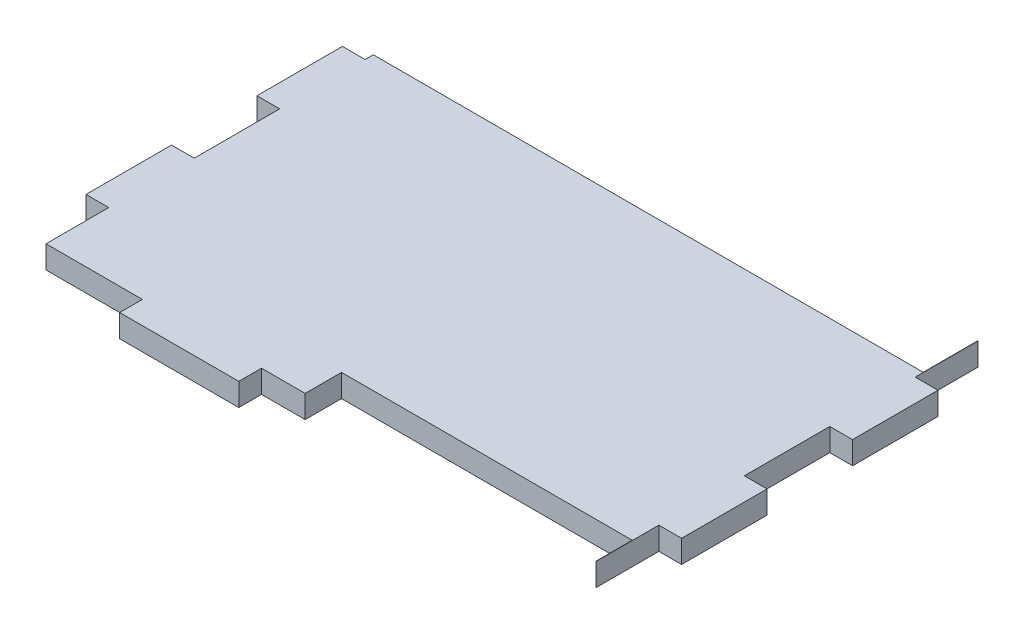
ISO-10303-21;
HEADER;
FILE_DESCRIPTION(('STEP AP214'),'2;1');
FILE_NAME('part.step','',(''),(''),'','','');
FILE_SCHEMA(('AUTOMOTIVE_DESIGN { 1 0 10303 214 1 1 1 1 }'));
ENDSEC;
DATA;
#1=APPLICATION_CONTEXT('core data for automotive mechanical design processes');
#2=APPLICATION_PROTOCOL_DEFINITION('international standard','automotive_design',2000,#1);
#3=PRODUCT_CONTEXT('',#1,'mechanical');
#4=PRODUCT('Part','Part','',(#3));
#5=PRODUCT_RELATED_PRODUCT_CATEGORY('part','',(#4));
#6=PRODUCT_DEFINITION_FORMATION('','',#4);
#7=PRODUCT_DEFINITION_CONTEXT('part definition',#1,'design');
#8=PRODUCT_DEFINITION('design','',#6,#7);
#9=PRODUCT_DEFINITION_SHAPE('','',#8);
#10=(LENGTH_UNIT() NAMED_UNIT(*) SI_UNIT(.MILLI.,.METRE.));
#11=(NAMED_UNIT(*) PLANE_ANGLE_UNIT() SI_UNIT($,.RADIAN.));
#12=(NAMED_UNIT(*) SI_UNIT($,.STERADIAN.) SOLID_ANGLE_UNIT());
#13=UNCERTAINTY_MEASURE_WITH_UNIT(LENGTH_MEASURE(1.E-05),#10,'distance_accuracy_value','');
#14=(GEOMETRIC_REPRESENTATION_CONTEXT(3) GLOBAL_UNCERTAINTY_ASSIGNED_CONTEXT((#13)) GLOBAL_UNIT_ASSIGNED_CONTEXT((#10,
#11,#12)) REPRESENTATION_CONTEXT('',''));
#15=CARTESIAN_POINT('',(0.,0.,0.));
#16=DIRECTION('',(0.,0.,1.));
#17=DIRECTION('',(1.,0.,0.));
#18=AXIS2_PLACEMENT_3D('',#15,#16,#17);
#19=CARTESIAN_POINT('',(41.5925,3.175,29.845));
#20=DIRECTION('',(-1.,0.,0.));
#21=DIRECTION('',(0.,0.,1.));
#22=AXIS2_PLACEMENT_3D('',#19,#20,#21);
#23=PLANE('',#22);
#24=DIRECTION('',(0.,0.,-1.));
#25=VECTOR('',#24,1.);
#26=CARTESIAN_POINT('',(41.5925,3.175,29.845));
#27=LINE('',#26,#25);
#28=CARTESIAN_POINT('',(41.5925,3.175,17.907));
#29=VERTEX_POINT('',#28);
#30=CARTESIAN_POINT('',(41.5925,3.175,5.96899999999999));
#31=VERTEX_POINT('',#30);
#32=EDGE_CURVE('E434',#29,#31,#27,.T.);
#33=ORIENTED_EDGE('',*,*,#32,.F.);
#34=DIRECTION('',(0.,1.,0.));
#35=VECTOR('',#34,1.);
#36=CARTESIAN_POINT('',(41.5925,0.,17.907));
#37=LINE('',#36,#35);
#38=CARTESIAN_POINT('',(41.5925,0.,17.907));
#39=VERTEX_POINT('',#38);
#40=EDGE_CURVE('E328',#39,#29,#37,.T.);
#41=ORIENTED_EDGE('',*,*,#40,.F.);
#42=DIRECTION('',(0.,0.,-1.));
#43=VECTOR('',#42,1.);
#44=CARTESIAN_POINT('',(41.5925,0.,29.845));
#45=LINE('',#44,#43);
#46=CARTESIAN_POINT('',(41.5925,0.,5.96899999999999));
#47=VERTEX_POINT('',#46);
#48=EDGE_CURVE('E445',#39,#47,#45,.T.);
#49=ORIENTED_EDGE('',*,*,#48,.T.);
#50=DIRECTION('',(0.,1.,0.));
#51=VECTOR('',#50,1.);
#52=CARTESIAN_POINT('',(41.5925,0.,5.96899999999999));
#53=LINE('',#52,#51);
#54=EDGE_CURVE('E351',#47,#31,#53,.T.);
#55=ORIENTED_EDGE('',*,*,#54,.T.);
#56=EDGE_LOOP('',(#33,#41,#49,#55));
#57=FACE_BOUND('',#56,.T.);
#58=ADVANCED_FACE('F35',(#57),#23,.F.);
#59=CARTESIAN_POINT('',(-41.5925,3.175,29.845));
#60=DIRECTION('',(1.,0.,0.));
#61=DIRECTION('',(0.,0.,-1.));
#62=AXIS2_PLACEMENT_3D('',#59,#60,#61);
#63=PLANE('',#62);
#64=DIRECTION('',(0.,0.,1.));
#65=VECTOR('',#64,1.);
#66=CARTESIAN_POINT('',(-41.5925,0.,29.845));
#67=LINE('',#66,#65);
#68=CARTESIAN_POINT('',(-41.5925,0.,-17.907));
#69=VERTEX_POINT('',#68);
#70=CARTESIAN_POINT('',(-41.5925,0.,-5.96900000000001));
#71=VERTEX_POINT('',#70);
#72=EDGE_CURVE('E446',#69,#71,#67,.T.);
#73=ORIENTED_EDGE('',*,*,#72,.T.);
#74=DIRECTION('',(0.,1.,0.));
#75=VECTOR('',#74,1.);
#76=CARTESIAN_POINT('',(-41.5925,0.,-5.96900000000001));
#77=LINE('',#76,#75);
#78=CARTESIAN_POINT('',(-41.5925,3.175,-5.96900000000001));
#79=VERTEX_POINT('',#78);
#80=EDGE_CURVE('E313',#71,#79,#77,.T.);
#81=ORIENTED_EDGE('',*,*,#80,.T.);
#82=DIRECTION('',(0.,0.,1.));
#83=VECTOR('',#82,1.);
#84=CARTESIAN_POINT('',(-41.5925,3.175,29.845));
#85=LINE('',#84,#83);
#86=CARTESIAN_POINT('',(-41.5925,3.175,-17.907));
#87=VERTEX_POINT('',#86);
#88=EDGE_CURVE('E436',#87,#79,#85,.T.);
#89=ORIENTED_EDGE('',*,*,#88,.F.);
#90=DIRECTION('',(0.,1.,0.));
#91=VECTOR('',#90,1.);
#92=CARTESIAN_POINT('',(-41.5925,0.,-17.907));
#93=LINE('',#92,#91);
#94=EDGE_CURVE('E386',#69,#87,#93,.T.);
#95=ORIENTED_EDGE('',*,*,#94,.F.);
#96=EDGE_LOOP('',(#73,#81,#89,#95));
#97=FACE_BOUND('',#96,.T.);
#98=ADVANCED_FACE('F497',(#97),#63,.F.);
#99=CARTESIAN_POINT('',(-41.5925,3.175,29.845));
#100=DIRECTION('',(0.,0.,-1.));
#101=DIRECTION('',(-1.,0.,0.));
#102=AXIS2_PLACEMENT_3D('',#99,#100,#101);
#103=PLANE('',#102);
#104=DIRECTION('',(1.,0.,0.));
#105=VECTOR('',#104,1.);
#106=CARTESIAN_POINT('',(-41.5925,0.,29.845));
#107=LINE('',#106,#105);
#108=CARTESIAN_POINT('',(-24.9555,0.,29.845));
#109=VERTEX_POINT('',#108);
#110=CARTESIAN_POINT('',(-8.31850000000001,0.,29.845));
#111=VERTEX_POINT('',#110);
#112=EDGE_CURVE('E435',#109,#111,#107,.T.);
#113=ORIENTED_EDGE('',*,*,#112,.T.);
#114=DIRECTION('',(0.,1.,0.));
#115=VECTOR('',#114,1.);
#116=CARTESIAN_POINT('',(-8.31850000000001,0.,29.845));
#117=LINE('',#116,#115);
#118=CARTESIAN_POINT('',(-8.31850000000001,3.175,29.845));
#119=VERTEX_POINT('',#118);
#120=EDGE_CURVE('E403',#111,#119,#117,.T.);
#121=ORIENTED_EDGE('',*,*,#120,.T.);
#122=DIRECTION('',(1.,0.,0.));
#123=VECTOR('',#122,1.);
#124=CARTESIAN_POINT('',(-41.5925,3.175,29.845));
#125=LINE('',#124,#123);
#126=CARTESIAN_POINT('',(-24.9555,3.175,29.845));
#127=VERTEX_POINT('',#126);
#128=EDGE_CURVE('E439',#127,#119,#125,.T.);
#129=ORIENTED_EDGE('',*,*,#128,.F.);
#130=DIRECTION('',(0.,1.,0.));
#131=VECTOR('',#130,1.);
#132=CARTESIAN_POINT('',(-24.9555,0.,29.845));
#133=LINE('',#132,#131);
#134=EDGE_CURVE('E423',#109,#127,#133,.T.);
#135=ORIENTED_EDGE('',*,*,#134,.F.);
#136=EDGE_LOOP('',(#113,#121,#129,#135));
#137=FACE_BOUND('',#136,.T.);
#138=ADVANCED_FACE('F540',(#137),#103,.F.);
#139=CARTESIAN_POINT('',(41.5925,3.175,-5.96900000000001));
#140=VERTEX_POINT('',#139);
#141=CARTESIAN_POINT('',(41.5925,3.175,-17.907));
#142=VERTEX_POINT('',#141);
#143=EDGE_CURVE('E432',#140,#142,#27,.T.);
#144=ORIENTED_EDGE('',*,*,#143,.F.);
#145=DIRECTION('',(0.,1.,0.));
#146=VECTOR('',#145,1.);
#147=CARTESIAN_POINT('',(41.5925,0.,-5.96900000000001));
#148=LINE('',#147,#146);
#149=CARTESIAN_POINT('',(41.5925,0.,-5.96900000000001));
#150=VERTEX_POINT('',#149);
#151=EDGE_CURVE('E344',#150,#140,#148,.T.);
#152=ORIENTED_EDGE('',*,*,#151,.F.);
#153=CARTESIAN_POINT('',(41.5925,0.,-17.907));
#154=VERTEX_POINT('',#153);
#155=EDGE_CURVE('E430',#150,#154,#45,.T.);
#156=ORIENTED_EDGE('',*,*,#155,.T.);
#157=DIRECTION('',(0.,1.,0.));
#158=VECTOR('',#157,1.);
#159=CARTESIAN_POINT('',(41.5925,0.,-17.907));
#160=LINE('',#159,#158);
#161=EDGE_CURVE('E373',#154,#142,#160,.T.);
#162=ORIENTED_EDGE('',*,*,#161,.T.);
#163=EDGE_LOOP('',(#144,#152,#156,#162));
#164=FACE_BOUND('',#163,.T.);
#165=ADVANCED_FACE('F37',(#164),#23,.F.);
#166=CARTESIAN_POINT('',(-41.5925,3.175,5.96899999999999));
#167=VERTEX_POINT('',#166);
#168=CARTESIAN_POINT('',(-41.5925,3.175,17.907));
#169=VERTEX_POINT('',#168);
#170=EDGE_CURVE('E440',#167,#169,#85,.T.);
#171=ORIENTED_EDGE('',*,*,#170,.F.);
#172=DIRECTION('',(0.,1.,0.));
#173=VECTOR('',#172,1.);
#174=CARTESIAN_POINT('',(-41.5925,0.,5.96899999999999));
#175=LINE('',#174,#173);
#176=CARTESIAN_POINT('',(-41.5925,0.,5.96899999999999));
#177=VERTEX_POINT('',#176);
#178=EDGE_CURVE('E304',#177,#167,#175,.T.);
#179=ORIENTED_EDGE('',*,*,#178,.F.);
#180=CARTESIAN_POINT('',(-41.5925,0.,17.907));
#181=VERTEX_POINT('',#180);
#182=EDGE_CURVE('E449',#177,#181,#67,.T.);
#183=ORIENTED_EDGE('',*,*,#182,.T.);
#184=DIRECTION('',(0.,1.,0.));
#185=VECTOR('',#184,1.);
#186=CARTESIAN_POINT('',(-41.5925,0.,17.907));
#187=LINE('',#186,#185);
#188=EDGE_CURVE('E288',#181,#169,#187,.T.);
#189=ORIENTED_EDGE('',*,*,#188,.T.);
#190=EDGE_LOOP('',(#171,#179,#183,#189));
#191=FACE_BOUND('',#190,.T.);
#192=ADVANCED_FACE('F515',(#191),#63,.F.);
#193=CARTESIAN_POINT('',(0.,3.175,0.));
#194=DIRECTION('',(0.,-1.,0.));
#195=DIRECTION('',(0.,0.,-1.));
#196=AXIS2_PLACEMENT_3D('',#193,#194,#195);
#197=PLANE('',#196);
#198=DIRECTION('',(-1.,0.,0.));
#199=VECTOR('',#198,1.);
#200=CARTESIAN_POINT('',(-8.31850000000001,3.175,26.67));
#201=LINE('',#200,#199);
#202=CARTESIAN_POINT('',(-2.2225,3.175,26.67));
#203=VERTEX_POINT('',#202);
#204=CARTESIAN_POINT('',(-8.31850000000001,3.175,26.67));
#205=VERTEX_POINT('',#204);
#206=EDGE_CURVE('E401',#203,#205,#201,.T.);
#207=ORIENTED_EDGE('',*,*,#206,.F.);
#208=DIRECTION('',(0.,0.,1.));
#209=VECTOR('',#208,1.);
#210=CARTESIAN_POINT('',(-2.2225,3.175,21.59));
#211=LINE('',#210,#209);
#212=CARTESIAN_POINT('',(-2.2225,3.175,21.59));
#213=VERTEX_POINT('',#212);
#214=EDGE_CURVE('E50',#213,#203,#211,.T.);
#215=ORIENTED_EDGE('',*,*,#214,.F.);
#216=DIRECTION('',(-1.,0.,0.));
#217=VECTOR('',#216,1.);
#218=CARTESIAN_POINT('',(-2.2225,3.175,21.59));
#219=LINE('',#218,#217);
#220=CARTESIAN_POINT('',(38.3840670883249,3.175,21.59));
#221=VERTEX_POINT('',#220);
#222=EDGE_CURVE('E257',#221,#213,#219,.T.);
#223=ORIENTED_EDGE('',*,*,#222,.F.);
#224=DIRECTION('',(0.,0.,-1.));
#225=VECTOR('',#224,1.);
#226=CARTESIAN_POINT('',(38.3840670883249,3.175,21.59));
#227=LINE('',#226,#225);
#228=CARTESIAN_POINT('',(38.3840670883249,3.175,26.67));
#229=VERTEX_POINT('',#228);
#230=EDGE_CURVE('E237',#229,#221,#227,.T.);
#231=ORIENTED_EDGE('',*,*,#230,.F.);
#232=DIRECTION('',(-1.,0.,0.));
#233=VECTOR('',#232,1.);
#234=CARTESIAN_POINT('',(24.9555,3.175,26.67));
#235=LINE('',#234,#233);
#236=CARTESIAN_POINT('',(38.4175,3.175,26.67));
#237=VERTEX_POINT('',#236);
#238=EDGE_CURVE('E376',#237,#229,#235,.T.);
#239=ORIENTED_EDGE('',*,*,#238,.F.);
#240=DIRECTION('',(0.,0.,1.));
#241=VECTOR('',#240,1.);
#242=CARTESIAN_POINT('',(38.4175,3.175,17.907));
#243=LINE('',#242,#241);
#244=CARTESIAN_POINT('',(38.4175,3.175,17.907));
#245=VERTEX_POINT('',#244);
#246=EDGE_CURVE('E326',#245,#237,#243,.T.);
#247=ORIENTED_EDGE('',*,*,#246,.F.);
#248=DIRECTION('',(-1.,0.,0.));
#249=VECTOR('',#248,1.);
#250=CARTESIAN_POINT('',(41.5925,3.175,17.907));
#251=LINE('',#250,#249);
#252=EDGE_CURVE('E291',#29,#245,#251,.T.);
#253=ORIENTED_EDGE('',*,*,#252,.F.);
#254=ORIENTED_EDGE('',*,*,#32,.T.);
#255=DIRECTION('',(1.,0.,0.));
#256=VECTOR('',#255,1.);
#257=CARTESIAN_POINT('',(41.5925,3.175,5.96899999999999));
#258=LINE('',#257,#256);
#259=CARTESIAN_POINT('',(38.4175,3.175,5.96899999999999));
#260=VERTEX_POINT('',#259);
#261=EDGE_CURVE('E338',#260,#31,#258,.T.);
#262=ORIENTED_EDGE('',*,*,#261,.F.);
#263=DIRECTION('',(0.,0.,1.));
#264=VECTOR('',#263,1.);
#265=CARTESIAN_POINT('',(38.4175,3.175,-5.96900000000001));
#266=LINE('',#265,#264);
#267=CARTESIAN_POINT('',(38.4175,3.175,-5.96900000000001));
#268=VERTEX_POINT('',#267);
#269=EDGE_CURVE('E347',#268,#260,#266,.T.);
#270=ORIENTED_EDGE('',*,*,#269,.F.);
#271=DIRECTION('',(-1.,0.,0.));
#272=VECTOR('',#271,1.);
#273=CARTESIAN_POINT('',(41.5925,3.175,-5.96900000000001));
#274=LINE('',#273,#272);
#275=EDGE_CURVE('E316',#140,#268,#274,.T.);
#276=ORIENTED_EDGE('',*,*,#275,.F.);
#277=ORIENTED_EDGE('',*,*,#143,.T.);
#278=DIRECTION('',(1.,0.,0.));
#279=VECTOR('',#278,1.);
#280=CARTESIAN_POINT('',(41.5925,3.175,-17.907));
#281=LINE('',#280,#279);
#282=CARTESIAN_POINT('',(38.4175,3.175,-17.907));
#283=VERTEX_POINT('',#282);
#284=EDGE_CURVE('E364',#283,#142,#281,.T.);
#285=ORIENTED_EDGE('',*,*,#284,.F.);
#286=DIRECTION('',(0.,0.,1.));
#287=VECTOR('',#286,1.);
#288=CARTESIAN_POINT('',(38.4175,3.175,-29.845));
#289=LINE('',#288,#287);
#290=CARTESIAN_POINT('',(38.4175,3.175,-26.67));
#291=VERTEX_POINT('',#290);
#292=EDGE_CURVE('E368',#291,#283,#289,.T.);
#293=ORIENTED_EDGE('',*,*,#292,.F.);
#294=DIRECTION('',(1.,0.,0.));
#295=VECTOR('',#294,1.);
#296=CARTESIAN_POINT('',(24.9555,3.175,-26.67));
#297=LINE('',#296,#295);
#298=CARTESIAN_POINT('',(38.3840670883249,3.175,-26.67));
#299=VERTEX_POINT('',#298);
#300=EDGE_CURVE('E394',#299,#291,#297,.T.);
#301=ORIENTED_EDGE('',*,*,#300,.F.);
#302=DIRECTION('',(0.,0.,-1.));
#303=VECTOR('',#302,1.);
#304=CARTESIAN_POINT('',(38.3840670883249,3.175,-19.05));
#305=LINE('',#304,#303);
#306=CARTESIAN_POINT('',(38.3840670883249,3.175,-19.05));
#307=VERTEX_POINT('',#306);
#308=EDGE_CURVE('E268',#307,#299,#305,.T.);
#309=ORIENTED_EDGE('',*,*,#308,.F.);
#310=DIRECTION('',(1.,0.,0.));
#311=VECTOR('',#310,1.);
#312=CARTESIAN_POINT('',(-38.4175,3.175,-19.05));
#313=LINE('',#312,#311);
#314=CARTESIAN_POINT('',(-38.4175,3.175,-19.05));
#315=VERTEX_POINT('',#314);
#316=EDGE_CURVE('E272',#315,#307,#313,.T.);
#317=ORIENTED_EDGE('',*,*,#316,.F.);
#318=DIRECTION('',(0.,0.,-1.));
#319=VECTOR('',#318,1.);
#320=CARTESIAN_POINT('',(-38.4175,3.175,-29.845));
#321=LINE('',#320,#319);
#322=CARTESIAN_POINT('',(-38.4175,3.175,-17.907));
#323=VERTEX_POINT('',#322);
#324=EDGE_CURVE('E383',#323,#315,#321,.T.);
#325=ORIENTED_EDGE('',*,*,#324,.F.);
#326=DIRECTION('',(1.,0.,0.));
#327=VECTOR('',#326,1.);
#328=CARTESIAN_POINT('',(-41.5925,3.175,-17.907));
#329=LINE('',#328,#327);
#330=EDGE_CURVE('E354',#87,#323,#329,.T.);
#331=ORIENTED_EDGE('',*,*,#330,.F.);
#332=ORIENTED_EDGE('',*,*,#88,.T.);
#333=DIRECTION('',(-1.,0.,0.));
#334=VECTOR('',#333,1.);
#335=CARTESIAN_POINT('',(-41.5925,3.175,-5.96900000000001));
#336=LINE('',#335,#334);
#337=CARTESIAN_POINT('',(-38.4175,3.175,-5.96900000000001));
#338=VERTEX_POINT('',#337);
#339=EDGE_CURVE('E298',#338,#79,#336,.T.);
#340=ORIENTED_EDGE('',*,*,#339,.F.);
#341=DIRECTION('',(0.,0.,-1.));
#342=VECTOR('',#341,1.);
#343=CARTESIAN_POINT('',(-38.4175,3.175,-5.96900000000001));
#344=LINE('',#343,#342);
#345=CARTESIAN_POINT('',(-38.4175,3.175,5.96899999999999));
#346=VERTEX_POINT('',#345);
#347=EDGE_CURVE('E308',#346,#338,#344,.T.);
#348=ORIENTED_EDGE('',*,*,#347,.F.);
#349=DIRECTION('',(1.,0.,0.));
#350=VECTOR('',#349,1.);
#351=CARTESIAN_POINT('',(-41.5925,3.175,5.96899999999999));
#352=LINE('',#351,#350);
#353=EDGE_CURVE('E305',#167,#346,#352,.T.);
#354=ORIENTED_EDGE('',*,*,#353,.F.);
#355=ORIENTED_EDGE('',*,*,#170,.T.);
#356=DIRECTION('',(-1.,0.,0.));
#357=VECTOR('',#356,1.);
#358=CARTESIAN_POINT('',(-41.5925,3.175,17.907));
#359=LINE('',#358,#357);
#360=CARTESIAN_POINT('',(-38.4175,3.175,17.907));
#361=VERTEX_POINT('',#360);
#362=EDGE_CURVE('E282',#361,#169,#359,.T.);
#363=ORIENTED_EDGE('',*,*,#362,.F.);
#364=DIRECTION('',(0.,0.,-1.));
#365=VECTOR('',#364,1.);
#366=CARTESIAN_POINT('',(-38.4175,3.175,17.907));
#367=LINE('',#366,#365);
#368=CARTESIAN_POINT('',(-38.4175,3.175,26.67));
#369=VERTEX_POINT('',#368);
#370=EDGE_CURVE('E264',#369,#361,#367,.T.);
#371=ORIENTED_EDGE('',*,*,#370,.F.);
#372=DIRECTION('',(-1.,0.,0.));
#373=VECTOR('',#372,1.);
#374=CARTESIAN_POINT('',(-41.5925,3.175,26.67));
#375=LINE('',#374,#373);
#376=CARTESIAN_POINT('',(-24.9555,3.175,26.67));
#377=VERTEX_POINT('',#376);
#378=EDGE_CURVE('E420',#377,#369,#375,.T.);
#379=ORIENTED_EDGE('',*,*,#378,.F.);
#380=DIRECTION('',(0.,0.,-1.));
#381=VECTOR('',#380,1.);
#382=CARTESIAN_POINT('',(-24.9555,3.175,29.845));
#383=LINE('',#382,#381);
#384=EDGE_CURVE('E411',#127,#377,#383,.T.);
#385=ORIENTED_EDGE('',*,*,#384,.F.);
#386=ORIENTED_EDGE('',*,*,#128,.T.);
#387=DIRECTION('',(0.,0.,1.));
#388=VECTOR('',#387,1.);
#389=CARTESIAN_POINT('',(-8.31850000000001,3.175,29.845));
#390=LINE('',#389,#388);
#391=EDGE_CURVE('E404',#205,#119,#390,.T.);
#392=ORIENTED_EDGE('',*,*,#391,.F.);
#393=EDGE_LOOP('',(#207,#215,#223,#231,#239,#247,#253,#254,#262,#270,#276,#277,#285,#293,#301,
#309,#317,#325,#331,#332,#340,#348,#354,#355,#363,#371,#379,#385,#386,#392));
#394=FACE_BOUND('',#393,.T.);
#395=ADVANCED_FACE('F473',(#394),#197,.F.);
#396=CARTESIAN_POINT('',(0.,0.,0.));
#397=DIRECTION('',(0.,-1.,0.));
#398=DIRECTION('',(0.,0.,-1.));
#399=AXIS2_PLACEMENT_3D('',#396,#397,#398);
#400=PLANE('',#399);
#401=DIRECTION('',(0.,0.,1.));
#402=VECTOR('',#401,1.);
#403=CARTESIAN_POINT('',(-2.2225,0.,21.59));
#404=LINE('',#403,#402);
#405=CARTESIAN_POINT('',(-2.2225,0.,21.59));
#406=VERTEX_POINT('',#405);
#407=CARTESIAN_POINT('',(-2.2225,0.,26.67));
#408=VERTEX_POINT('',#407);
#409=EDGE_CURVE('E255',#406,#408,#404,.T.);
#410=ORIENTED_EDGE('',*,*,#409,.T.);
#411=DIRECTION('',(-1.,0.,0.));
#412=VECTOR('',#411,1.);
#413=CARTESIAN_POINT('',(-8.31850000000001,0.,26.67));
#414=LINE('',#413,#412);
#415=CARTESIAN_POINT('',(-8.31850000000001,0.,26.67));
#416=VERTEX_POINT('',#415);
#417=EDGE_CURVE('E400',#408,#416,#414,.T.);
#418=ORIENTED_EDGE('',*,*,#417,.T.);
#419=DIRECTION('',(0.,0.,1.));
#420=VECTOR('',#419,1.);
#421=CARTESIAN_POINT('',(-8.31850000000001,0.,29.845));
#422=LINE('',#421,#420);
#423=EDGE_CURVE('E397',#416,#111,#422,.T.);
#424=ORIENTED_EDGE('',*,*,#423,.T.);
#425=ORIENTED_EDGE('',*,*,#112,.F.);
#426=DIRECTION('',(0.,0.,-1.));
#427=VECTOR('',#426,1.);
#428=CARTESIAN_POINT('',(-24.9555,0.,29.845));
#429=LINE('',#428,#427);
#430=CARTESIAN_POINT('',(-24.9555,0.,26.67));
#431=VERTEX_POINT('',#430);
#432=EDGE_CURVE('E416',#109,#431,#429,.T.);
#433=ORIENTED_EDGE('',*,*,#432,.T.);
#434=DIRECTION('',(-1.,0.,0.));
#435=VECTOR('',#434,1.);
#436=CARTESIAN_POINT('',(-41.5925,0.,26.67));
#437=LINE('',#436,#435);
#438=CARTESIAN_POINT('',(-38.4175,0.,26.67));
#439=VERTEX_POINT('',#438);
#440=EDGE_CURVE('E419',#431,#439,#437,.T.);
#441=ORIENTED_EDGE('',*,*,#440,.T.);
#442=DIRECTION('',(0.,0.,-1.));
#443=VECTOR('',#442,1.);
#444=CARTESIAN_POINT('',(-38.4175,0.,17.907));
#445=LINE('',#444,#443);
#446=CARTESIAN_POINT('',(-38.4175,0.,17.907));
#447=VERTEX_POINT('',#446);
#448=EDGE_CURVE('E278',#439,#447,#445,.T.);
#449=ORIENTED_EDGE('',*,*,#448,.T.);
#450=DIRECTION('',(-1.,0.,0.));
#451=VECTOR('',#450,1.);
#452=CARTESIAN_POINT('',(-41.5925,0.,17.907));
#453=LINE('',#452,#451);
#454=EDGE_CURVE('E281',#447,#181,#453,.T.);
#455=ORIENTED_EDGE('',*,*,#454,.T.);
#456=ORIENTED_EDGE('',*,*,#182,.F.);
#457=DIRECTION('',(1.,0.,0.));
#458=VECTOR('',#457,1.);
#459=CARTESIAN_POINT('',(-41.5925,0.,5.96899999999999));
#460=LINE('',#459,#458);
#461=CARTESIAN_POINT('',(-38.4175,0.,5.96899999999999));
#462=VERTEX_POINT('',#461);
#463=EDGE_CURVE('E294',#177,#462,#460,.T.);
#464=ORIENTED_EDGE('',*,*,#463,.T.);
#465=DIRECTION('',(0.,0.,-1.));
#466=VECTOR('',#465,1.);
#467=CARTESIAN_POINT('',(-38.4175,0.,-5.96900000000001));
#468=LINE('',#467,#466);
#469=CARTESIAN_POINT('',(-38.4175,0.,-5.96900000000001));
#470=VERTEX_POINT('',#469);
#471=EDGE_CURVE('E297',#462,#470,#468,.T.);
#472=ORIENTED_EDGE('',*,*,#471,.T.);
#473=DIRECTION('',(-1.,0.,0.));
#474=VECTOR('',#473,1.);
#475=CARTESIAN_POINT('',(-41.5925,0.,-5.96900000000001));
#476=LINE('',#475,#474);
#477=EDGE_CURVE('E301',#470,#71,#476,.T.);
#478=ORIENTED_EDGE('',*,*,#477,.T.);
#479=ORIENTED_EDGE('',*,*,#72,.F.);
#480=DIRECTION('',(1.,0.,0.));
#481=VECTOR('',#480,1.);
#482=CARTESIAN_POINT('',(-41.5925,0.,-17.907));
#483=LINE('',#482,#481);
#484=CARTESIAN_POINT('',(-38.4175,0.,-17.907));
#485=VERTEX_POINT('',#484);
#486=EDGE_CURVE('E379',#69,#485,#483,.T.);
#487=ORIENTED_EDGE('',*,*,#486,.T.);
#488=DIRECTION('',(0.,0.,-1.));
#489=VECTOR('',#488,1.);
#490=CARTESIAN_POINT('',(-38.4175,0.,-29.845));
#491=LINE('',#490,#489);
#492=CARTESIAN_POINT('',(-38.4175,0.,-19.05));
#493=VERTEX_POINT('',#492);
#494=EDGE_CURVE('E382',#485,#493,#491,.T.);
#495=ORIENTED_EDGE('',*,*,#494,.T.);
#496=DIRECTION('',(1.,0.,0.));
#497=VECTOR('',#496,1.);
#498=CARTESIAN_POINT('',(-38.4175,0.,-19.05));
#499=LINE('',#498,#497);
#500=CARTESIAN_POINT('',(38.3840670883249,0.,-19.05));
#501=VERTEX_POINT('',#500);
#502=EDGE_CURVE('E58',#493,#501,#499,.T.);
#503=ORIENTED_EDGE('',*,*,#502,.T.);
#504=DIRECTION('',(0.,0.,-1.));
#505=VECTOR('',#504,1.);
#506=CARTESIAN_POINT('',(38.3840670883249,0.,-19.05));
#507=LINE('',#506,#505);
#508=CARTESIAN_POINT('',(38.3840670883249,0.,-26.67));
#509=VERTEX_POINT('',#508);
#510=EDGE_CURVE('E267',#501,#509,#507,.T.);
#511=ORIENTED_EDGE('',*,*,#510,.T.);
#512=DIRECTION('',(1.,0.,0.));
#513=VECTOR('',#512,1.);
#514=CARTESIAN_POINT('',(24.9555,0.,-26.67));
#515=LINE('',#514,#513);
#516=CARTESIAN_POINT('',(38.4175,0.,-26.67));
#517=VERTEX_POINT('',#516);
#518=EDGE_CURVE('E406',#509,#517,#515,.T.);
#519=ORIENTED_EDGE('',*,*,#518,.T.);
#520=DIRECTION('',(0.,0.,1.));
#521=VECTOR('',#520,1.);
#522=CARTESIAN_POINT('',(38.4175,0.,-29.845));
#523=LINE('',#522,#521);
#524=CARTESIAN_POINT('',(38.4175,0.,-17.907));
#525=VERTEX_POINT('',#524);
#526=EDGE_CURVE('E360',#517,#525,#523,.T.);
#527=ORIENTED_EDGE('',*,*,#526,.T.);
#528=DIRECTION('',(1.,0.,0.));
#529=VECTOR('',#528,1.);
#530=CARTESIAN_POINT('',(41.5925,0.,-17.907));
#531=LINE('',#530,#529);
#532=EDGE_CURVE('E363',#525,#154,#531,.T.);
#533=ORIENTED_EDGE('',*,*,#532,.T.);
#534=ORIENTED_EDGE('',*,*,#155,.F.);
#535=DIRECTION('',(-1.,0.,0.));
#536=VECTOR('',#535,1.);
#537=CARTESIAN_POINT('',(41.5925,0.,-5.96900000000001));
#538=LINE('',#537,#536);
#539=CARTESIAN_POINT('',(38.4175,0.,-5.96900000000001));
#540=VERTEX_POINT('',#539);
#541=EDGE_CURVE('E334',#150,#540,#538,.T.);
#542=ORIENTED_EDGE('',*,*,#541,.T.);
#543=DIRECTION('',(0.,0.,1.));
#544=VECTOR('',#543,1.);
#545=CARTESIAN_POINT('',(38.4175,0.,-5.96900000000001));
#546=LINE('',#545,#544);
#547=CARTESIAN_POINT('',(38.4175,0.,5.96899999999999));
#548=VERTEX_POINT('',#547);
#549=EDGE_CURVE('E337',#540,#548,#546,.T.);
#550=ORIENTED_EDGE('',*,*,#549,.T.);
#551=DIRECTION('',(1.,0.,0.));
#552=VECTOR('',#551,1.);
#553=CARTESIAN_POINT('',(41.5925,0.,5.96899999999999));
#554=LINE('',#553,#552);
#555=EDGE_CURVE('E341',#548,#47,#554,.T.);
#556=ORIENTED_EDGE('',*,*,#555,.T.);
#557=ORIENTED_EDGE('',*,*,#48,.F.);
#558=DIRECTION('',(-1.,0.,0.));
#559=VECTOR('',#558,1.);
#560=CARTESIAN_POINT('',(41.5925,0.,17.907));
#561=LINE('',#560,#559);
#562=CARTESIAN_POINT('',(38.4175,0.,17.907));
#563=VERTEX_POINT('',#562);
#564=EDGE_CURVE('E322',#39,#563,#561,.T.);
#565=ORIENTED_EDGE('',*,*,#564,.T.);
#566=DIRECTION('',(0.,0.,1.));
#567=VECTOR('',#566,1.);
#568=CARTESIAN_POINT('',(38.4175,0.,17.907));
#569=LINE('',#568,#567);
#570=CARTESIAN_POINT('',(38.4175,0.,26.67));
#571=VERTEX_POINT('',#570);
#572=EDGE_CURVE('E325',#563,#571,#569,.T.);
#573=ORIENTED_EDGE('',*,*,#572,.T.);
#574=DIRECTION('',(-1.,0.,0.));
#575=VECTOR('',#574,1.);
#576=CARTESIAN_POINT('',(24.9555,0.,26.67));
#577=LINE('',#576,#575);
#578=CARTESIAN_POINT('',(38.3840670883249,0.,26.67));
#579=VERTEX_POINT('',#578);
#580=EDGE_CURVE('E254',#571,#579,#577,.T.);
#581=ORIENTED_EDGE('',*,*,#580,.T.);
#582=DIRECTION('',(0.,0.,-1.));
#583=VECTOR('',#582,1.);
#584=CARTESIAN_POINT('',(38.3840670883249,0.,21.59));
#585=LINE('',#584,#583);
#586=CARTESIAN_POINT('',(38.3840670883249,0.,21.59));
#587=VERTEX_POINT('',#586);
#588=EDGE_CURVE('E235',#579,#587,#585,.T.);
#589=ORIENTED_EDGE('',*,*,#588,.T.);
#590=DIRECTION('',(-1.,0.,0.));
#591=VECTOR('',#590,1.);
#592=CARTESIAN_POINT('',(-2.2225,0.,21.59));
#593=LINE('',#592,#591);
#594=EDGE_CURVE('E242',#587,#406,#593,.T.);
#595=ORIENTED_EDGE('',*,*,#594,.T.);
#596=EDGE_LOOP('',(#410,#418,#424,#425,#433,#441,#449,#455,#456,#464,#472,#478,#479,#487,#495,
#503,#511,#519,#527,#533,#534,#542,#550,#556,#557,#565,#573,#581,#589,#595));
#597=FACE_BOUND('',#596,.T.);
#598=ADVANCED_FACE('F251',(#597),#400,.T.);
#599=CARTESIAN_POINT('',(-41.5925,0.,26.67));
#600=DIRECTION('',(0.,0.,-1.));
#601=DIRECTION('',(-1.,0.,0.));
#602=AXIS2_PLACEMENT_3D('',#599,#600,#601);
#603=PLANE('',#602);
#604=ORIENTED_EDGE('',*,*,#378,.T.);
#605=DIRECTION('',(0.,-1.,0.));
#606=VECTOR('',#605,1.);
#607=CARTESIAN_POINT('',(-38.4175,0.,26.67));
#608=LINE('',#607,#606);
#609=EDGE_CURVE('E457',#369,#439,#608,.T.);
#610=ORIENTED_EDGE('',*,*,#609,.T.);
#611=ORIENTED_EDGE('',*,*,#440,.F.);
#612=DIRECTION('',(0.,1.,0.));
#613=VECTOR('',#612,1.);
#614=CARTESIAN_POINT('',(-24.9555,0.,26.67));
#615=LINE('',#614,#613);
#616=EDGE_CURVE('E428',#431,#377,#615,.T.);
#617=ORIENTED_EDGE('',*,*,#616,.T.);
#618=EDGE_LOOP('',(#604,#610,#611,#617));
#619=FACE_BOUND('',#618,.T.);
#620=ADVANCED_FACE('F556',(#619),#603,.F.);
#621=CARTESIAN_POINT('',(-24.9555,0.,29.845));
#622=DIRECTION('',(1.,0.,0.));
#623=DIRECTION('',(0.,0.,-1.));
#624=AXIS2_PLACEMENT_3D('',#621,#622,#623);
#625=PLANE('',#624);
#626=ORIENTED_EDGE('',*,*,#384,.T.);
#627=ORIENTED_EDGE('',*,*,#616,.F.);
#628=ORIENTED_EDGE('',*,*,#432,.F.);
#629=ORIENTED_EDGE('',*,*,#134,.T.);
#630=EDGE_LOOP('',(#626,#627,#628,#629));
#631=FACE_BOUND('',#630,.T.);
#632=ADVANCED_FACE('F559',(#631),#625,.F.);
#633=CARTESIAN_POINT('',(24.9555,0.,26.67));
#634=DIRECTION('',(0.,0.,-1.));
#635=DIRECTION('',(-1.,0.,0.));
#636=AXIS2_PLACEMENT_3D('',#633,#634,#635);
#637=PLANE('',#636);
#638=ORIENTED_EDGE('',*,*,#238,.T.);
#639=DIRECTION('',(0.,-1.,0.));
#640=VECTOR('',#639,1.);
#641=CARTESIAN_POINT('',(38.3840670883249,0.,26.67));
#642=LINE('',#641,#640);
#643=EDGE_CURVE('E11',#229,#579,#642,.T.);
#644=ORIENTED_EDGE('',*,*,#643,.T.);
#645=ORIENTED_EDGE('',*,*,#580,.F.);
#646=DIRECTION('',(0.,1.,0.));
#647=VECTOR('',#646,1.);
#648=CARTESIAN_POINT('',(38.4175,0.,26.67));
#649=LINE('',#648,#647);
#650=EDGE_CURVE('E454',#571,#237,#649,.T.);
#651=ORIENTED_EDGE('',*,*,#650,.T.);
#652=EDGE_LOOP('',(#638,#644,#645,#651));
#653=FACE_BOUND('',#652,.T.);
#654=ADVANCED_FACE('F562',(#653),#637,.F.);
#655=CARTESIAN_POINT('',(24.9555,0.,-26.67));
#656=DIRECTION('',(0.,0.,1.));
#657=DIRECTION('',(1.,0.,0.));
#658=AXIS2_PLACEMENT_3D('',#655,#656,#657);
#659=PLANE('',#658);
#660=ORIENTED_EDGE('',*,*,#518,.F.);
#661=DIRECTION('',(0.,1.,0.));
#662=VECTOR('',#661,1.);
#663=CARTESIAN_POINT('',(38.3840670883249,0.,-26.67));
#664=LINE('',#663,#662);
#665=EDGE_CURVE('E43',#509,#299,#664,.T.);
#666=ORIENTED_EDGE('',*,*,#665,.T.);
#667=ORIENTED_EDGE('',*,*,#300,.T.);
#668=DIRECTION('',(0.,-1.,0.));
#669=VECTOR('',#668,1.);
#670=CARTESIAN_POINT('',(38.4175,0.,-26.67));
#671=LINE('',#670,#669);
#672=EDGE_CURVE('E443',#291,#517,#671,.T.);
#673=ORIENTED_EDGE('',*,*,#672,.T.);
#674=EDGE_LOOP('',(#660,#666,#667,#673));
#675=FACE_BOUND('',#674,.T.);
#676=ADVANCED_FACE('F465',(#675),#659,.F.);
#677=CARTESIAN_POINT('',(-8.31850000000001,0.,29.845));
#678=DIRECTION('',(-1.,0.,0.));
#679=DIRECTION('',(0.,0.,1.));
#680=AXIS2_PLACEMENT_3D('',#677,#678,#679);
#681=PLANE('',#680);
#682=ORIENTED_EDGE('',*,*,#391,.T.);
#683=ORIENTED_EDGE('',*,*,#120,.F.);
#684=ORIENTED_EDGE('',*,*,#423,.F.);
#685=DIRECTION('',(0.,1.,0.));
#686=VECTOR('',#685,1.);
#687=CARTESIAN_POINT('',(-8.31850000000001,0.,26.67));
#688=LINE('',#687,#686);
#689=EDGE_CURVE('E408',#416,#205,#688,.T.);
#690=ORIENTED_EDGE('',*,*,#689,.T.);
#691=EDGE_LOOP('',(#682,#683,#684,#690));
#692=FACE_BOUND('',#691,.T.);
#693=ADVANCED_FACE('F569',(#692),#681,.F.);
#694=CARTESIAN_POINT('',(-8.31850000000001,0.,26.67));
#695=DIRECTION('',(0.,0.,-1.));
#696=DIRECTION('',(-1.,0.,0.));
#697=AXIS2_PLACEMENT_3D('',#694,#695,#696);
#698=PLANE('',#697);
#699=ORIENTED_EDGE('',*,*,#417,.F.);
#700=DIRECTION('',(0.,1.,0.));
#701=VECTOR('',#700,1.);
#702=CARTESIAN_POINT('',(-2.2225,0.,26.67));
#703=LINE('',#702,#701);
#704=EDGE_CURVE('E460',#408,#203,#703,.T.);
#705=ORIENTED_EDGE('',*,*,#704,.T.);
#706=ORIENTED_EDGE('',*,*,#206,.T.);
#707=ORIENTED_EDGE('',*,*,#689,.F.);
#708=EDGE_LOOP('',(#699,#705,#706,#707));
#709=FACE_BOUND('',#708,.T.);
#710=ADVANCED_FACE('F572',(#709),#698,.F.);
#711=CARTESIAN_POINT('',(38.4175,0.,-29.845));
#712=DIRECTION('',(-1.,0.,0.));
#713=DIRECTION('',(0.,0.,1.));
#714=AXIS2_PLACEMENT_3D('',#711,#712,#713);
#715=PLANE('',#714);
#716=ORIENTED_EDGE('',*,*,#292,.T.);
#717=DIRECTION('',(0.,1.,0.));
#718=VECTOR('',#717,1.);
#719=CARTESIAN_POINT('',(38.4175,0.,-17.907));
#720=LINE('',#719,#718);
#721=EDGE_CURVE('E367',#525,#283,#720,.T.);
#722=ORIENTED_EDGE('',*,*,#721,.F.);
#723=ORIENTED_EDGE('',*,*,#526,.F.);
#724=ORIENTED_EDGE('',*,*,#672,.F.);
#725=EDGE_LOOP('',(#716,#722,#723,#724));
#726=FACE_BOUND('',#725,.T.);
#727=ADVANCED_FACE('F477',(#726),#715,.F.);
#728=CARTESIAN_POINT('',(41.5925,0.,-17.907));
#729=DIRECTION('',(0.,0.,1.));
#730=DIRECTION('',(1.,0.,0.));
#731=AXIS2_PLACEMENT_3D('',#728,#729,#730);
#732=PLANE('',#731);
#733=ORIENTED_EDGE('',*,*,#284,.T.);
#734=ORIENTED_EDGE('',*,*,#161,.F.);
#735=ORIENTED_EDGE('',*,*,#532,.F.);
#736=ORIENTED_EDGE('',*,*,#721,.T.);
#737=EDGE_LOOP('',(#733,#734,#735,#736));
#738=FACE_BOUND('',#737,.T.);
#739=ADVANCED_FACE('F481',(#738),#732,.F.);
#740=CARTESIAN_POINT('',(-38.4175,0.,-29.845));
#741=DIRECTION('',(1.,0.,0.));
#742=DIRECTION('',(0.,0.,-1.));
#743=AXIS2_PLACEMENT_3D('',#740,#741,#742);
#744=PLANE('',#743);
#745=ORIENTED_EDGE('',*,*,#324,.T.);
#746=DIRECTION('',(0.,1.,0.));
#747=VECTOR('',#746,1.);
#748=CARTESIAN_POINT('',(-38.4175,0.,-19.05));
#749=LINE('',#748,#747);
#750=EDGE_CURVE('E271',#493,#315,#749,.T.);
#751=ORIENTED_EDGE('',*,*,#750,.F.);
#752=ORIENTED_EDGE('',*,*,#494,.F.);
#753=DIRECTION('',(0.,1.,0.));
#754=VECTOR('',#753,1.);
#755=CARTESIAN_POINT('',(-38.4175,0.,-17.907));
#756=LINE('',#755,#754);
#757=EDGE_CURVE('E370',#485,#323,#756,.T.);
#758=ORIENTED_EDGE('',*,*,#757,.T.);
#759=EDGE_LOOP('',(#745,#751,#752,#758));
#760=FACE_BOUND('',#759,.T.);
#761=ADVANCED_FACE('F489',(#760),#744,.F.);
#762=CARTESIAN_POINT('',(-41.5925,0.,-17.907));
#763=DIRECTION('',(0.,0.,1.));
#764=DIRECTION('',(1.,0.,0.));
#765=AXIS2_PLACEMENT_3D('',#762,#763,#764);
#766=PLANE('',#765);
#767=ORIENTED_EDGE('',*,*,#330,.T.);
#768=ORIENTED_EDGE('',*,*,#757,.F.);
#769=ORIENTED_EDGE('',*,*,#486,.F.);
#770=ORIENTED_EDGE('',*,*,#94,.T.);
#771=EDGE_LOOP('',(#767,#768,#769,#770));
#772=FACE_BOUND('',#771,.T.);
#773=ADVANCED_FACE('F492',(#772),#766,.F.);
#774=CARTESIAN_POINT('',(38.4175,0.,17.907));
#775=DIRECTION('',(-1.,0.,0.));
#776=DIRECTION('',(0.,0.,1.));
#777=AXIS2_PLACEMENT_3D('',#774,#775,#776);
#778=PLANE('',#777);
#779=ORIENTED_EDGE('',*,*,#572,.F.);
#780=DIRECTION('',(0.,1.,0.));
#781=VECTOR('',#780,1.);
#782=CARTESIAN_POINT('',(38.4175,0.,17.907));
#783=LINE('',#782,#781);
#784=EDGE_CURVE('E309',#563,#245,#783,.T.);
#785=ORIENTED_EDGE('',*,*,#784,.T.);
#786=ORIENTED_EDGE('',*,*,#246,.T.);
#787=ORIENTED_EDGE('',*,*,#650,.F.);
#788=EDGE_LOOP('',(#779,#785,#786,#787));
#789=FACE_BOUND('',#788,.T.);
#790=ADVANCED_FACE('F582',(#789),#778,.F.);
#791=CARTESIAN_POINT('',(41.5925,0.,17.907));
#792=DIRECTION('',(0.,0.,-1.));
#793=DIRECTION('',(-1.,0.,0.));
#794=AXIS2_PLACEMENT_3D('',#791,#792,#793);
#795=PLANE('',#794);
#796=ORIENTED_EDGE('',*,*,#252,.T.);
#797=ORIENTED_EDGE('',*,*,#784,.F.);
#798=ORIENTED_EDGE('',*,*,#564,.F.);
#799=ORIENTED_EDGE('',*,*,#40,.T.);
#800=EDGE_LOOP('',(#796,#797,#798,#799));
#801=FACE_BOUND('',#800,.T.);
#802=ADVANCED_FACE('F596',(#801),#795,.F.);
#803=CARTESIAN_POINT('',(-38.4175,0.,17.907));
#804=DIRECTION('',(1.,0.,0.));
#805=DIRECTION('',(0.,0.,-1.));
#806=AXIS2_PLACEMENT_3D('',#803,#804,#805);
#807=PLANE('',#806);
#808=ORIENTED_EDGE('',*,*,#370,.T.);
#809=DIRECTION('',(0.,1.,0.));
#810=VECTOR('',#809,1.);
#811=CARTESIAN_POINT('',(-38.4175,0.,17.907));
#812=LINE('',#811,#810);
#813=EDGE_CURVE('E285',#447,#361,#812,.T.);
#814=ORIENTED_EDGE('',*,*,#813,.F.);
#815=ORIENTED_EDGE('',*,*,#448,.F.);
#816=ORIENTED_EDGE('',*,*,#609,.F.);
#817=EDGE_LOOP('',(#808,#814,#815,#816));
#818=FACE_BOUND('',#817,.T.);
#819=ADVANCED_FACE('F599',(#818),#807,.F.);
#820=CARTESIAN_POINT('',(-41.5925,0.,17.907));
#821=DIRECTION('',(0.,0.,-1.));
#822=DIRECTION('',(-1.,0.,0.));
#823=AXIS2_PLACEMENT_3D('',#820,#821,#822);
#824=PLANE('',#823);
#825=ORIENTED_EDGE('',*,*,#362,.T.);
#826=ORIENTED_EDGE('',*,*,#188,.F.);
#827=ORIENTED_EDGE('',*,*,#454,.F.);
#828=ORIENTED_EDGE('',*,*,#813,.T.);
#829=EDGE_LOOP('',(#825,#826,#827,#828));
#830=FACE_BOUND('',#829,.T.);
#831=ADVANCED_FACE('F595',(#830),#824,.F.);
#832=CARTESIAN_POINT('',(41.5925,0.,5.96899999999999));
#833=DIRECTION('',(0.,0.,1.));
#834=DIRECTION('',(1.,0.,0.));
#835=AXIS2_PLACEMENT_3D('',#832,#833,#834);
#836=PLANE('',#835);
#837=ORIENTED_EDGE('',*,*,#261,.T.);
#838=ORIENTED_EDGE('',*,*,#54,.F.);
#839=ORIENTED_EDGE('',*,*,#555,.F.);
#840=DIRECTION('',(0.,1.,0.));
#841=VECTOR('',#840,1.);
#842=CARTESIAN_POINT('',(38.4175,0.,5.96899999999999));
#843=LINE('',#842,#841);
#844=EDGE_CURVE('E355',#548,#260,#843,.T.);
#845=ORIENTED_EDGE('',*,*,#844,.T.);
#846=EDGE_LOOP('',(#837,#838,#839,#845));
#847=FACE_BOUND('',#846,.T.);
#848=ADVANCED_FACE('F529',(#847),#836,.F.);
#849=CARTESIAN_POINT('',(38.4175,0.,-5.96900000000001));
#850=DIRECTION('',(-1.,0.,0.));
#851=DIRECTION('',(0.,0.,1.));
#852=AXIS2_PLACEMENT_3D('',#849,#850,#851);
#853=PLANE('',#852);
#854=ORIENTED_EDGE('',*,*,#269,.T.);
#855=ORIENTED_EDGE('',*,*,#844,.F.);
#856=ORIENTED_EDGE('',*,*,#549,.F.);
#857=DIRECTION('',(0.,1.,0.));
#858=VECTOR('',#857,1.);
#859=CARTESIAN_POINT('',(38.4175,0.,-5.96900000000001));
#860=LINE('',#859,#858);
#861=EDGE_CURVE('E357',#540,#268,#860,.T.);
#862=ORIENTED_EDGE('',*,*,#861,.T.);
#863=EDGE_LOOP('',(#854,#855,#856,#862));
#864=FACE_BOUND('',#863,.T.);
#865=ADVANCED_FACE('F532',(#864),#853,.F.);
#866=CARTESIAN_POINT('',(41.5925,0.,-5.96900000000001));
#867=DIRECTION('',(0.,0.,-1.));
#868=DIRECTION('',(-1.,0.,0.));
#869=AXIS2_PLACEMENT_3D('',#866,#867,#868);
#870=PLANE('',#869);
#871=ORIENTED_EDGE('',*,*,#275,.T.);
#872=ORIENTED_EDGE('',*,*,#861,.F.);
#873=ORIENTED_EDGE('',*,*,#541,.F.);
#874=ORIENTED_EDGE('',*,*,#151,.T.);
#875=EDGE_LOOP('',(#871,#872,#873,#874));
#876=FACE_BOUND('',#875,.T.);
#877=ADVANCED_FACE('F534',(#876),#870,.F.);
#878=CARTESIAN_POINT('',(-41.5925,0.,-5.96900000000001));
#879=DIRECTION('',(0.,0.,-1.));
#880=DIRECTION('',(-1.,0.,0.));
#881=AXIS2_PLACEMENT_3D('',#878,#879,#880);
#882=PLANE('',#881);
#883=ORIENTED_EDGE('',*,*,#339,.T.);
#884=ORIENTED_EDGE('',*,*,#80,.F.);
#885=ORIENTED_EDGE('',*,*,#477,.F.);
#886=DIRECTION('',(0.,1.,0.));
#887=VECTOR('',#886,1.);
#888=CARTESIAN_POINT('',(-38.4175,0.,-5.96900000000001));
#889=LINE('',#888,#887);
#890=EDGE_CURVE('E317',#470,#338,#889,.T.);
#891=ORIENTED_EDGE('',*,*,#890,.T.);
#892=EDGE_LOOP('',(#883,#884,#885,#891));
#893=FACE_BOUND('',#892,.T.);
#894=ADVANCED_FACE('F501',(#893),#882,.F.);
#895=CARTESIAN_POINT('',(-38.4175,0.,-5.96900000000001));
#896=DIRECTION('',(1.,0.,0.));
#897=DIRECTION('',(0.,0.,-1.));
#898=AXIS2_PLACEMENT_3D('',#895,#896,#897);
#899=PLANE('',#898);
#900=ORIENTED_EDGE('',*,*,#347,.T.);
#901=ORIENTED_EDGE('',*,*,#890,.F.);
#902=ORIENTED_EDGE('',*,*,#471,.F.);
#903=DIRECTION('',(0.,1.,0.));
#904=VECTOR('',#903,1.);
#905=CARTESIAN_POINT('',(-38.4175,0.,5.96899999999999));
#906=LINE('',#905,#904);
#907=EDGE_CURVE('E319',#462,#346,#906,.T.);
#908=ORIENTED_EDGE('',*,*,#907,.T.);
#909=EDGE_LOOP('',(#900,#901,#902,#908));
#910=FACE_BOUND('',#909,.T.);
#911=ADVANCED_FACE('F505',(#910),#899,.F.);
#912=CARTESIAN_POINT('',(-41.5925,0.,5.96899999999999));
#913=DIRECTION('',(0.,0.,1.));
#914=DIRECTION('',(1.,0.,0.));
#915=AXIS2_PLACEMENT_3D('',#912,#913,#914);
#916=PLANE('',#915);
#917=ORIENTED_EDGE('',*,*,#353,.T.);
#918=ORIENTED_EDGE('',*,*,#907,.F.);
#919=ORIENTED_EDGE('',*,*,#463,.F.);
#920=ORIENTED_EDGE('',*,*,#178,.T.);
#921=EDGE_LOOP('',(#917,#918,#919,#920));
#922=FACE_BOUND('',#921,.T.);
#923=ADVANCED_FACE('F507',(#922),#916,.F.);
#924=CARTESIAN_POINT('',(38.3840670883249,0.,-19.05));
#925=DIRECTION('',(1.,0.,0.));
#926=DIRECTION('',(0.,0.,-1.));
#927=AXIS2_PLACEMENT_3D('',#924,#925,#926);
#928=PLANE('',#927);
#929=ORIENTED_EDGE('',*,*,#510,.F.);
#930=DIRECTION('',(0.,1.,0.));
#931=VECTOR('',#930,1.);
#932=CARTESIAN_POINT('',(38.3840670883249,0.,-19.05));
#933=LINE('',#932,#931);
#934=EDGE_CURVE('E261',#501,#307,#933,.T.);
#935=ORIENTED_EDGE('',*,*,#934,.T.);
#936=ORIENTED_EDGE('',*,*,#308,.T.);
#937=ORIENTED_EDGE('',*,*,#665,.F.);
#938=EDGE_LOOP('',(#929,#935,#936,#937));
#939=FACE_BOUND('',#938,.T.);
#940=ADVANCED_FACE('F484',(#939),#928,.F.);
#941=CARTESIAN_POINT('',(-38.4175,0.,-19.05));
#942=DIRECTION('',(0.,0.,1.));
#943=DIRECTION('',(1.,0.,0.));
#944=AXIS2_PLACEMENT_3D('',#941,#942,#943);
#945=PLANE('',#944);
#946=ORIENTED_EDGE('',*,*,#316,.T.);
#947=ORIENTED_EDGE('',*,*,#934,.F.);
#948=ORIENTED_EDGE('',*,*,#502,.F.);
#949=ORIENTED_EDGE('',*,*,#750,.T.);
#950=EDGE_LOOP('',(#946,#947,#948,#949));
#951=FACE_BOUND('',#950,.T.);
#952=ADVANCED_FACE('F485',(#951),#945,.F.);
#953=CARTESIAN_POINT('',(38.3840670883249,0.,21.59));
#954=DIRECTION('',(1.,0.,0.));
#955=DIRECTION('',(0.,0.,-1.));
#956=AXIS2_PLACEMENT_3D('',#953,#954,#955);
#957=PLANE('',#956);
#958=ORIENTED_EDGE('',*,*,#230,.T.);
#959=DIRECTION('',(0.,1.,0.));
#960=VECTOR('',#959,1.);
#961=CARTESIAN_POINT('',(38.3840670883249,0.,21.59));
#962=LINE('',#961,#960);
#963=EDGE_CURVE('E231',#587,#221,#962,.T.);
#964=ORIENTED_EDGE('',*,*,#963,.F.);
#965=ORIENTED_EDGE('',*,*,#588,.F.);
#966=ORIENTED_EDGE('',*,*,#643,.F.);
#967=EDGE_LOOP('',(#958,#964,#965,#966));
#968=FACE_BOUND('',#967,.T.);
#969=ADVANCED_FACE('F233',(#968),#957,.F.);
#970=CARTESIAN_POINT('',(-2.2225,0.,21.59));
#971=DIRECTION('',(-1.,0.,0.));
#972=DIRECTION('',(0.,0.,1.));
#973=AXIS2_PLACEMENT_3D('',#970,#971,#972);
#974=PLANE('',#973);
#975=ORIENTED_EDGE('',*,*,#409,.F.);
#976=DIRECTION('',(0.,1.,0.));
#977=VECTOR('',#976,1.);
#978=CARTESIAN_POINT('',(-2.2225,0.,21.59));
#979=LINE('',#978,#977);
#980=EDGE_CURVE('E241',#406,#213,#979,.T.);
#981=ORIENTED_EDGE('',*,*,#980,.T.);
#982=ORIENTED_EDGE('',*,*,#214,.T.);
#983=ORIENTED_EDGE('',*,*,#704,.F.);
#984=EDGE_LOOP('',(#975,#981,#982,#983));
#985=FACE_BOUND('',#984,.T.);
#986=ADVANCED_FACE('F620',(#985),#974,.F.);
#987=CARTESIAN_POINT('',(-2.2225,0.,21.59));
#988=DIRECTION('',(0.,0.,-1.));
#989=DIRECTION('',(-1.,0.,0.));
#990=AXIS2_PLACEMENT_3D('',#987,#988,#989);
#991=PLANE('',#990);
#992=ORIENTED_EDGE('',*,*,#222,.T.);
#993=ORIENTED_EDGE('',*,*,#980,.F.);
#994=ORIENTED_EDGE('',*,*,#594,.F.);
#995=ORIENTED_EDGE('',*,*,#963,.T.);
#996=EDGE_LOOP('',(#992,#993,#994,#995));
#997=FACE_BOUND('',#996,.T.);
#998=ADVANCED_FACE('F245',(#997),#991,.F.);
#999=CLOSED_SHELL('',(#58,#98,#138,#165,#192,#395,#598,#620,#632,#654,#676,#693,#710,#727,#739,
#761,#773,#790,#802,#819,#831,#848,#865,#877,#894,#911,#923,#940,#952,#969,#986,#998));
#1000=MANIFOLD_SOLID_BREP('B2',#999);
#1001=ADVANCED_BREP_SHAPE_REPRESENTATION('',(#18,#1000),#14);
#1002=SHAPE_DEFINITION_REPRESENTATION(#9,#1001);
ENDSEC;
END-ISO-10303-21;
